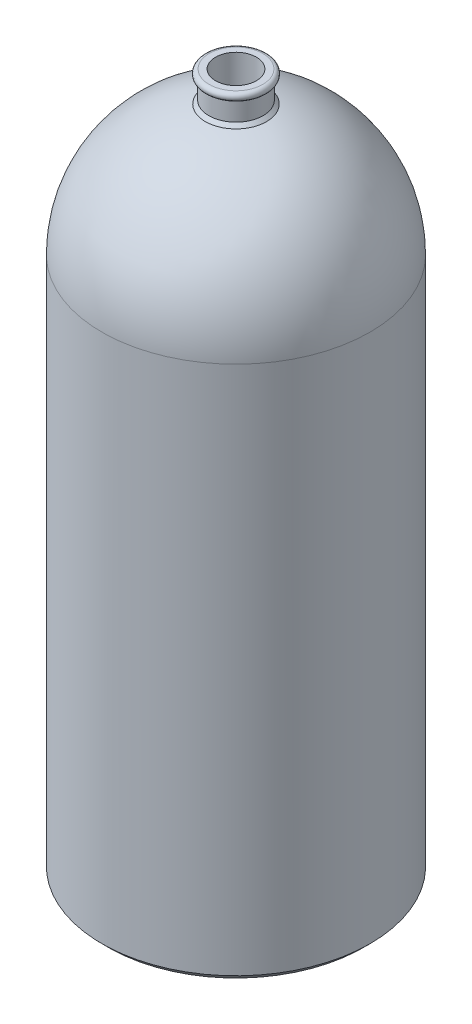
ISO-10303-21;
HEADER;
FILE_DESCRIPTION(('STEP AP214'),'2;1');
FILE_NAME('part.step','',(''),(''),'','','');
FILE_SCHEMA(('AUTOMOTIVE_DESIGN { 1 0 10303 214 1 1 1 1 }'));
ENDSEC;
DATA;
#1=APPLICATION_CONTEXT('core data for automotive mechanical design processes');
#2=APPLICATION_PROTOCOL_DEFINITION('international standard','automotive_design',2000,#1);
#3=PRODUCT_CONTEXT('',#1,'mechanical');
#4=PRODUCT('Part','Part','',(#3));
#5=PRODUCT_RELATED_PRODUCT_CATEGORY('part','',(#4));
#6=PRODUCT_DEFINITION_FORMATION('','',#4);
#7=PRODUCT_DEFINITION_CONTEXT('part definition',#1,'design');
#8=PRODUCT_DEFINITION('design','',#6,#7);
#9=PRODUCT_DEFINITION_SHAPE('','',#8);
#10=(LENGTH_UNIT() NAMED_UNIT(*) SI_UNIT(.MILLI.,.METRE.));
#11=(NAMED_UNIT(*) PLANE_ANGLE_UNIT() SI_UNIT($,.RADIAN.));
#12=(NAMED_UNIT(*) SI_UNIT($,.STERADIAN.) SOLID_ANGLE_UNIT());
#13=UNCERTAINTY_MEASURE_WITH_UNIT(LENGTH_MEASURE(1.E-05),#10,'distance_accuracy_value','');
#14=(GEOMETRIC_REPRESENTATION_CONTEXT(3) GLOBAL_UNCERTAINTY_ASSIGNED_CONTEXT((#13)) GLOBAL_UNIT_ASSIGNED_CONTEXT((#10,
#11,#12)) REPRESENTATION_CONTEXT('',''));
#15=CARTESIAN_POINT('',(0.,0.,0.));
#16=DIRECTION('',(0.,0.,1.));
#17=DIRECTION('',(1.,0.,0.));
#18=AXIS2_PLACEMENT_3D('',#15,#16,#17);
#19=CARTESIAN_POINT('',(-10.253117738076,0.,0.));
#20=DIRECTION('',(0.,1.,0.));
#21=DIRECTION('',(-1.,0.,0.));
#22=AXIS2_PLACEMENT_3D('',#19,#20,#21);
#23=PLANE('',#22);
#24=CARTESIAN_POINT('',(0.,0.,0.));
#25=DIRECTION('',(0.,1.,0.));
#26=DIRECTION('',(-1.,0.,0.));
#27=AXIS2_PLACEMENT_3D('',#24,#25,#26);
#28=CIRCLE('',#27,8.25311773807597);
#29=CARTESIAN_POINT('',(-8.25311773807597,0.,0.));
#30=VERTEX_POINT('',#29);
#31=EDGE_CURVE('E99',#30,#30,#28,.F.);
#32=ORIENTED_EDGE('',*,*,#31,.T.);
#33=EDGE_LOOP('',(#32));
#34=FACE_BOUND('',#33,.T.);
#35=ADVANCED_FACE('F34',(#34),#23,.F.);
#36=CARTESIAN_POINT('',(-20.,520.,0.));
#37=DIRECTION('',(0.,-1.,0.));
#38=DIRECTION('',(1.,0.,0.));
#39=AXIS2_PLACEMENT_3D('',#36,#37,#38);
#40=PLANE('',#39);
#41=CARTESIAN_POINT('',(0.,520.,0.));
#42=DIRECTION('',(0.,-1.,0.));
#43=DIRECTION('',(1.,0.,0.));
#44=AXIS2_PLACEMENT_3D('',#41,#42,#43);
#45=CIRCLE('',#44,15.253117738076);
#46=CARTESIAN_POINT('',(15.253117738076,520.,0.));
#47=VERTEX_POINT('',#46);
#48=EDGE_CURVE('E129',#47,#47,#45,.T.);
#49=ORIENTED_EDGE('',*,*,#48,.T.);
#50=EDGE_LOOP('',(#49));
#51=FACE_BOUND('',#50,.T.);
#52=CARTESIAN_POINT('',(0.,520.,0.));
#53=DIRECTION('',(0.,-1.,0.));
#54=DIRECTION('',(1.,0.,0.));
#55=AXIS2_PLACEMENT_3D('',#52,#53,#54);
#56=CIRCLE('',#55,20.);
#57=CARTESIAN_POINT('',(20.,520.,0.));
#58=VERTEX_POINT('',#57);
#59=EDGE_CURVE('E102',#58,#58,#56,.T.);
#60=ORIENTED_EDGE('',*,*,#59,.F.);
#61=EDGE_LOOP('',(#60));
#62=FACE_BOUND('',#61,.T.);
#63=ADVANCED_FACE('F154',(#51,#62),#40,.F.);
#64=CARTESIAN_POINT('',(0.,517.,0.));
#65=DIRECTION('',(0.,-1.,0.));
#66=DIRECTION('',(1.,0.,0.));
#67=AXIS2_PLACEMENT_3D('',#64,#65,#66);
#68=TOROIDAL_SURFACE('',#67,20.,3.);
#69=CARTESIAN_POINT('',(0.,514.010697169795,0.));
#70=DIRECTION('',(0.,-1.,0.));
#71=DIRECTION('',(1.,0.,0.));
#72=AXIS2_PLACEMENT_3D('',#69,#70,#71);
#73=CIRCLE('',#72,20.253117738076);
#74=CARTESIAN_POINT('',(20.253117738076,514.010697169795,0.));
#75=VERTEX_POINT('',#74);
#76=EDGE_CURVE('E105',#75,#75,#73,.T.);
#77=ORIENTED_EDGE('',*,*,#76,.F.);
#78=EDGE_LOOP('',(#77));
#79=FACE_BOUND('',#78,.T.);
#80=ORIENTED_EDGE('',*,*,#59,.T.);
#81=EDGE_LOOP('',(#80));
#82=FACE_BOUND('',#81,.T.);
#83=ADVANCED_FACE('F160',(#79,#82),#68,.T.);
#84=CARTESIAN_POINT('',(0.,0.,0.));
#85=DIRECTION('',(0.,-1.,0.));
#86=DIRECTION('',(1.,0.,0.));
#87=AXIS2_PLACEMENT_3D('',#84,#85,#86);
#88=CYLINDRICAL_SURFACE('',#87,20.253117738076);
#89=CARTESIAN_POINT('',(0.,499.927581517607,0.));
#90=DIRECTION('',(0.,-1.,0.));
#91=DIRECTION('',(1.,0.,0.));
#92=AXIS2_PLACEMENT_3D('',#89,#90,#91);
#93=CIRCLE('',#92,20.253117738076);
#94=CARTESIAN_POINT('',(20.253117738076,499.927581517607,0.));
#95=VERTEX_POINT('',#94);
#96=EDGE_CURVE('E54',#95,#95,#93,.F.);
#97=ORIENTED_EDGE('',*,*,#96,.T.);
#98=EDGE_LOOP('',(#97));
#99=FACE_BOUND('',#98,.T.);
#100=ORIENTED_EDGE('',*,*,#76,.T.);
#101=EDGE_LOOP('',(#100));
#102=FACE_BOUND('',#101,.T.);
#103=ADVANCED_FACE('F218',(#99,#102),#88,.T.);
#104=CARTESIAN_POINT('',(-1.21430643318376E-13,400.,0.));
#105=DIRECTION('',(0.,-1.,0.));
#106=DIRECTION('',(-1.,0.,0.));
#107=AXIS2_PLACEMENT_3D('',#104,#105,#106);
#108=SPHERICAL_SURFACE('',#107,99.9999999999999);
#109=CARTESIAN_POINT('',(-1.21616808557346E-13,497.361650673066,0.));
#110=DIRECTION('',(0.,-1.,0.));
#111=DIRECTION('',(1.,0.,0.));
#112=AXIS2_PLACEMENT_3D('',#109,#110,#111);
#113=CIRCLE('',#112,22.8190485826174);
#114=CARTESIAN_POINT('',(22.8190485826173,497.361650673066,0.));
#115=VERTEX_POINT('',#114);
#116=EDGE_CURVE('E57',#115,#115,#113,.T.);
#117=ORIENTED_EDGE('',*,*,#116,.T.);
#118=EDGE_LOOP('',(#117));
#119=FACE_BOUND('',#118,.T.);
#120=CARTESIAN_POINT('',(0.,400.,0.));
#121=DIRECTION('',(0.,-1.,0.));
#122=DIRECTION('',(1.,0.,0.));
#123=AXIS2_PLACEMENT_3D('',#120,#121,#122);
#124=CIRCLE('',#123,100.);
#125=CARTESIAN_POINT('',(100.,400.,0.));
#126=VERTEX_POINT('',#125);
#127=EDGE_CURVE('E108',#126,#126,#124,.T.);
#128=ORIENTED_EDGE('',*,*,#127,.F.);
#129=EDGE_LOOP('',(#128));
#130=FACE_BOUND('',#129,.T.);
#131=ADVANCED_FACE('F223',(#119,#130),#108,.T.);
#132=CARTESIAN_POINT('',(0.,0.,0.));
#133=DIRECTION('',(0.,-1.,0.));
#134=DIRECTION('',(1.,0.,0.));
#135=AXIS2_PLACEMENT_3D('',#132,#133,#134);
#136=CYLINDRICAL_SURFACE('',#135,100.);
#137=ORIENTED_EDGE('',*,*,#127,.T.);
#138=EDGE_LOOP('',(#137));
#139=FACE_BOUND('',#138,.T.);
#140=CARTESIAN_POINT('',(0.,5.00000000000014,0.));
#141=DIRECTION('',(0.,1.,0.));
#142=DIRECTION('',(-1.,0.,0.));
#143=AXIS2_PLACEMENT_3D('',#140,#141,#142);
#144=CIRCLE('',#143,100.);
#145=CARTESIAN_POINT('',(-100.,5.00000000000014,0.));
#146=VERTEX_POINT('',#145);
#147=EDGE_CURVE('E60',#146,#146,#144,.T.);
#148=ORIENTED_EDGE('',*,*,#147,.T.);
#149=EDGE_LOOP('',(#148));
#150=FACE_BOUND('',#149,.T.);
#151=ADVANCED_FACE('F230',(#139,#150),#136,.T.);
#152=CARTESIAN_POINT('',(-100.,0.,0.));
#153=DIRECTION('',(0.,1.,0.));
#154=DIRECTION('',(-1.,0.,0.));
#155=AXIS2_PLACEMENT_3D('',#152,#153,#154);
#156=PLANE('',#155);
#157=CARTESIAN_POINT('',(0.,0.,0.));
#158=DIRECTION('',(0.,1.,0.));
#159=DIRECTION('',(-1.,0.,0.));
#160=AXIS2_PLACEMENT_3D('',#157,#158,#159);
#161=CIRCLE('',#160,94.9999999999999);
#162=CARTESIAN_POINT('',(-94.9999999999999,0.,0.));
#163=VERTEX_POINT('',#162);
#164=EDGE_CURVE('E63',#163,#163,#161,.F.);
#165=ORIENTED_EDGE('',*,*,#164,.T.);
#166=EDGE_LOOP('',(#165));
#167=FACE_BOUND('',#166,.T.);
#168=CARTESIAN_POINT('',(0.,0.,0.));
#169=DIRECTION('',(0.,1.,0.));
#170=DIRECTION('',(-1.,0.,0.));
#171=AXIS2_PLACEMENT_3D('',#168,#169,#170);
#172=CIRCLE('',#171,85.5485275751154);
#173=CARTESIAN_POINT('',(-85.5485275751154,0.,0.));
#174=VERTEX_POINT('',#173);
#175=EDGE_CURVE('E66',#174,#174,#172,.T.);
#176=ORIENTED_EDGE('',*,*,#175,.T.);
#177=EDGE_LOOP('',(#176));
#178=FACE_BOUND('',#177,.T.);
#179=ADVANCED_FACE('F234',(#167,#178),#156,.F.);
#180=CARTESIAN_POINT('',(0.,0.,0.));
#181=DIRECTION('',(0.,-1.,0.));
#182=DIRECTION('',(1.,0.,0.));
#183=AXIS2_PLACEMENT_3D('',#180,#181,#182);
#184=CYLINDRICAL_SURFACE('',#183,83.5485275751153);
#185=CARTESIAN_POINT('',(0.,2.00000000000014,0.));
#186=DIRECTION('',(0.,1.,0.));
#187=DIRECTION('',(-1.,0.,0.));
#188=AXIS2_PLACEMENT_3D('',#185,#186,#187);
#189=CIRCLE('',#188,83.5485275751153);
#190=CARTESIAN_POINT('',(-83.5485275751153,2.00000000000014,0.));
#191=VERTEX_POINT('',#190);
#192=EDGE_CURVE('E69',#191,#191,#189,.F.);
#193=ORIENTED_EDGE('',*,*,#192,.T.);
#194=EDGE_LOOP('',(#193));
#195=FACE_BOUND('',#194,.T.);
#196=CARTESIAN_POINT('',(0.,3.,0.));
#197=DIRECTION('',(0.,-1.,0.));
#198=DIRECTION('',(1.,0.,0.));
#199=AXIS2_PLACEMENT_3D('',#196,#197,#198);
#200=CIRCLE('',#199,83.5485275751153);
#201=CARTESIAN_POINT('',(83.5485275751153,3.,0.));
#202=VERTEX_POINT('',#201);
#203=EDGE_CURVE('E111',#202,#202,#200,.T.);
#204=ORIENTED_EDGE('',*,*,#203,.F.);
#205=EDGE_LOOP('',(#204));
#206=FACE_BOUND('',#205,.T.);
#207=ADVANCED_FACE('F238',(#195,#206),#184,.F.);
#208=CARTESIAN_POINT('',(-83.5485275751153,3.,0.));
#209=DIRECTION('',(0.,1.,0.));
#210=DIRECTION('',(-1.,0.,0.));
#211=AXIS2_PLACEMENT_3D('',#208,#209,#210);
#212=PLANE('',#211);
#213=CARTESIAN_POINT('',(0.,3.,0.));
#214=DIRECTION('',(0.,-1.,0.));
#215=DIRECTION('',(1.,0.,0.));
#216=AXIS2_PLACEMENT_3D('',#213,#214,#215);
#217=CIRCLE('',#216,73.5485275751153);
#218=CARTESIAN_POINT('',(73.5485275751153,3.,0.));
#219=VERTEX_POINT('',#218);
#220=EDGE_CURVE('E114',#219,#219,#217,.T.);
#221=ORIENTED_EDGE('',*,*,#220,.F.);
#222=EDGE_LOOP('',(#221));
#223=FACE_BOUND('',#222,.T.);
#224=ORIENTED_EDGE('',*,*,#203,.T.);
#225=EDGE_LOOP('',(#224));
#226=FACE_BOUND('',#225,.T.);
#227=ADVANCED_FACE('F242',(#223,#226),#212,.F.);
#228=CARTESIAN_POINT('',(0.,0.,0.));
#229=DIRECTION('',(0.,-1.,0.));
#230=DIRECTION('',(1.,0.,0.));
#231=AXIS2_PLACEMENT_3D('',#228,#229,#230);
#232=CYLINDRICAL_SURFACE('',#231,73.5485275751153);
#233=CARTESIAN_POINT('',(0.,2.00000000000011,0.));
#234=DIRECTION('',(0.,1.,0.));
#235=DIRECTION('',(-1.,0.,0.));
#236=AXIS2_PLACEMENT_3D('',#233,#234,#235);
#237=CIRCLE('',#236,73.5485275751153);
#238=CARTESIAN_POINT('',(-73.5485275751153,2.00000000000011,0.));
#239=VERTEX_POINT('',#238);
#240=EDGE_CURVE('E72',#239,#239,#237,.T.);
#241=ORIENTED_EDGE('',*,*,#240,.T.);
#242=EDGE_LOOP('',(#241));
#243=FACE_BOUND('',#242,.T.);
#244=ORIENTED_EDGE('',*,*,#220,.T.);
#245=EDGE_LOOP('',(#244));
#246=FACE_BOUND('',#245,.T.);
#247=ADVANCED_FACE('F246',(#243,#246),#232,.T.);
#248=CARTESIAN_POINT('',(-73.5485275751153,0.,0.));
#249=DIRECTION('',(0.,1.,0.));
#250=DIRECTION('',(-1.,0.,0.));
#251=AXIS2_PLACEMENT_3D('',#248,#249,#250);
#252=PLANE('',#251);
#253=CARTESIAN_POINT('',(0.,0.,0.));
#254=DIRECTION('',(0.,1.,0.));
#255=DIRECTION('',(-1.,0.,0.));
#256=AXIS2_PLACEMENT_3D('',#253,#254,#255);
#257=CIRCLE('',#256,65.5485275751153);
#258=CARTESIAN_POINT('',(-65.5485275751153,0.,0.));
#259=VERTEX_POINT('',#258);
#260=EDGE_CURVE('E75',#259,#259,#257,.T.);
#261=ORIENTED_EDGE('',*,*,#260,.T.);
#262=EDGE_LOOP('',(#261));
#263=FACE_BOUND('',#262,.T.);
#264=CARTESIAN_POINT('',(0.,0.,0.));
#265=DIRECTION('',(0.,1.,0.));
#266=DIRECTION('',(-1.,0.,0.));
#267=AXIS2_PLACEMENT_3D('',#264,#265,#266);
#268=CIRCLE('',#267,71.5485275751151);
#269=CARTESIAN_POINT('',(-71.5485275751151,0.,0.));
#270=VERTEX_POINT('',#269);
#271=EDGE_CURVE('E78',#270,#270,#268,.F.);
#272=ORIENTED_EDGE('',*,*,#271,.T.);
#273=EDGE_LOOP('',(#272));
#274=FACE_BOUND('',#273,.T.);
#275=ADVANCED_FACE('F250',(#263,#274),#252,.F.);
#276=CARTESIAN_POINT('',(0.,0.,0.));
#277=DIRECTION('',(0.,-1.,0.));
#278=DIRECTION('',(1.,0.,0.));
#279=AXIS2_PLACEMENT_3D('',#276,#277,#278);
#280=CYLINDRICAL_SURFACE('',#279,63.5485275751153);
#281=CARTESIAN_POINT('',(0.,1.99999999999992,0.));
#282=DIRECTION('',(0.,1.,0.));
#283=DIRECTION('',(-1.,0.,0.));
#284=AXIS2_PLACEMENT_3D('',#281,#282,#283);
#285=CIRCLE('',#284,63.5485275751153);
#286=CARTESIAN_POINT('',(-63.5485275751153,1.99999999999992,0.));
#287=VERTEX_POINT('',#286);
#288=EDGE_CURVE('E81',#287,#287,#285,.F.);
#289=ORIENTED_EDGE('',*,*,#288,.T.);
#290=EDGE_LOOP('',(#289));
#291=FACE_BOUND('',#290,.T.);
#292=CARTESIAN_POINT('',(0.,3.,0.));
#293=DIRECTION('',(0.,-1.,0.));
#294=DIRECTION('',(1.,0.,0.));
#295=AXIS2_PLACEMENT_3D('',#292,#293,#294);
#296=CIRCLE('',#295,63.5485275751153);
#297=CARTESIAN_POINT('',(63.5485275751153,3.,0.));
#298=VERTEX_POINT('',#297);
#299=EDGE_CURVE('E117',#298,#298,#296,.T.);
#300=ORIENTED_EDGE('',*,*,#299,.F.);
#301=EDGE_LOOP('',(#300));
#302=FACE_BOUND('',#301,.T.);
#303=ADVANCED_FACE('F254',(#291,#302),#280,.F.);
#304=CARTESIAN_POINT('',(-63.5485275751153,3.,0.));
#305=DIRECTION('',(0.,1.,0.));
#306=DIRECTION('',(-1.,0.,0.));
#307=AXIS2_PLACEMENT_3D('',#304,#305,#306);
#308=PLANE('',#307);
#309=CARTESIAN_POINT('',(0.,3.,0.));
#310=DIRECTION('',(0.,-1.,0.));
#311=DIRECTION('',(1.,0.,0.));
#312=AXIS2_PLACEMENT_3D('',#309,#310,#311);
#313=CIRCLE('',#312,53.5485275751153);
#314=CARTESIAN_POINT('',(53.5485275751153,3.,0.));
#315=VERTEX_POINT('',#314);
#316=EDGE_CURVE('E120',#315,#315,#313,.T.);
#317=ORIENTED_EDGE('',*,*,#316,.F.);
#318=EDGE_LOOP('',(#317));
#319=FACE_BOUND('',#318,.T.);
#320=ORIENTED_EDGE('',*,*,#299,.T.);
#321=EDGE_LOOP('',(#320));
#322=FACE_BOUND('',#321,.T.);
#323=ADVANCED_FACE('F258',(#319,#322),#308,.F.);
#324=CARTESIAN_POINT('',(0.,0.,0.));
#325=DIRECTION('',(0.,-1.,0.));
#326=DIRECTION('',(1.,0.,0.));
#327=AXIS2_PLACEMENT_3D('',#324,#325,#326);
#328=CYLINDRICAL_SURFACE('',#327,53.5485275751153);
#329=CARTESIAN_POINT('',(0.,2.00000000000008,0.));
#330=DIRECTION('',(0.,1.,0.));
#331=DIRECTION('',(-1.,0.,0.));
#332=AXIS2_PLACEMENT_3D('',#329,#330,#331);
#333=CIRCLE('',#332,53.5485275751153);
#334=CARTESIAN_POINT('',(-53.5485275751153,2.00000000000008,0.));
#335=VERTEX_POINT('',#334);
#336=EDGE_CURVE('E84',#335,#335,#333,.T.);
#337=ORIENTED_EDGE('',*,*,#336,.T.);
#338=EDGE_LOOP('',(#337));
#339=FACE_BOUND('',#338,.T.);
#340=ORIENTED_EDGE('',*,*,#316,.T.);
#341=EDGE_LOOP('',(#340));
#342=FACE_BOUND('',#341,.T.);
#343=ADVANCED_FACE('F262',(#339,#342),#328,.T.);
#344=CARTESIAN_POINT('',(-53.5485275751153,0.,0.));
#345=DIRECTION('',(0.,1.,0.));
#346=DIRECTION('',(-1.,0.,0.));
#347=AXIS2_PLACEMENT_3D('',#344,#345,#346);
#348=PLANE('',#347);
#349=CARTESIAN_POINT('',(0.,0.,0.));
#350=DIRECTION('',(0.,1.,0.));
#351=DIRECTION('',(-1.,0.,0.));
#352=AXIS2_PLACEMENT_3D('',#349,#350,#351);
#353=CIRCLE('',#352,22.2531177380761);
#354=CARTESIAN_POINT('',(-22.2531177380761,0.,0.));
#355=VERTEX_POINT('',#354);
#356=EDGE_CURVE('E87',#355,#355,#353,.T.);
#357=ORIENTED_EDGE('',*,*,#356,.T.);
#358=EDGE_LOOP('',(#357));
#359=FACE_BOUND('',#358,.T.);
#360=CARTESIAN_POINT('',(0.,0.,0.));
#361=DIRECTION('',(0.,1.,0.));
#362=DIRECTION('',(-1.,0.,0.));
#363=AXIS2_PLACEMENT_3D('',#360,#361,#362);
#364=CIRCLE('',#363,51.5485275751152);
#365=CARTESIAN_POINT('',(-51.5485275751152,0.,0.));
#366=VERTEX_POINT('',#365);
#367=EDGE_CURVE('E90',#366,#366,#364,.F.);
#368=ORIENTED_EDGE('',*,*,#367,.T.);
#369=EDGE_LOOP('',(#368));
#370=FACE_BOUND('',#369,.T.);
#371=ADVANCED_FACE('F266',(#359,#370),#348,.F.);
#372=CARTESIAN_POINT('',(0.,0.,0.));
#373=DIRECTION('',(0.,-1.,0.));
#374=DIRECTION('',(1.,0.,0.));
#375=AXIS2_PLACEMENT_3D('',#372,#373,#374);
#376=CYLINDRICAL_SURFACE('',#375,20.253117738076);
#377=CARTESIAN_POINT('',(0.,2.00000000000007,0.));
#378=DIRECTION('',(0.,1.,0.));
#379=DIRECTION('',(-1.,0.,0.));
#380=AXIS2_PLACEMENT_3D('',#377,#378,#379);
#381=CIRCLE('',#380,20.253117738076);
#382=CARTESIAN_POINT('',(-20.253117738076,2.00000000000007,0.));
#383=VERTEX_POINT('',#382);
#384=EDGE_CURVE('E93',#383,#383,#381,.F.);
#385=ORIENTED_EDGE('',*,*,#384,.T.);
#386=EDGE_LOOP('',(#385));
#387=FACE_BOUND('',#386,.T.);
#388=CARTESIAN_POINT('',(0.,3.,0.));
#389=DIRECTION('',(0.,-1.,0.));
#390=DIRECTION('',(1.,0.,0.));
#391=AXIS2_PLACEMENT_3D('',#388,#389,#390);
#392=CIRCLE('',#391,20.253117738076);
#393=CARTESIAN_POINT('',(20.253117738076,3.,0.));
#394=VERTEX_POINT('',#393);
#395=EDGE_CURVE('E123',#394,#394,#392,.T.);
#396=ORIENTED_EDGE('',*,*,#395,.F.);
#397=EDGE_LOOP('',(#396));
#398=FACE_BOUND('',#397,.T.);
#399=ADVANCED_FACE('F270',(#387,#398),#376,.F.);
#400=CARTESIAN_POINT('',(-20.253117738076,3.,0.));
#401=DIRECTION('',(0.,1.,0.));
#402=DIRECTION('',(-1.,0.,0.));
#403=AXIS2_PLACEMENT_3D('',#400,#401,#402);
#404=PLANE('',#403);
#405=CARTESIAN_POINT('',(0.,3.,0.));
#406=DIRECTION('',(0.,-1.,0.));
#407=DIRECTION('',(1.,0.,0.));
#408=AXIS2_PLACEMENT_3D('',#405,#406,#407);
#409=CIRCLE('',#408,10.253117738076);
#410=CARTESIAN_POINT('',(10.253117738076,3.,0.));
#411=VERTEX_POINT('',#410);
#412=EDGE_CURVE('E126',#411,#411,#409,.T.);
#413=ORIENTED_EDGE('',*,*,#412,.F.);
#414=EDGE_LOOP('',(#413));
#415=FACE_BOUND('',#414,.T.);
#416=ORIENTED_EDGE('',*,*,#395,.T.);
#417=EDGE_LOOP('',(#416));
#418=FACE_BOUND('',#417,.T.);
#419=ADVANCED_FACE('F274',(#415,#418),#404,.F.);
#420=CARTESIAN_POINT('',(0.,0.,0.));
#421=DIRECTION('',(0.,-1.,0.));
#422=DIRECTION('',(1.,0.,0.));
#423=AXIS2_PLACEMENT_3D('',#420,#421,#422);
#424=CYLINDRICAL_SURFACE('',#423,10.253117738076);
#425=CARTESIAN_POINT('',(0.,2.00000000000008,0.));
#426=DIRECTION('',(0.,1.,0.));
#427=DIRECTION('',(-1.,0.,0.));
#428=AXIS2_PLACEMENT_3D('',#425,#426,#427);
#429=CIRCLE('',#428,10.253117738076);
#430=CARTESIAN_POINT('',(-10.253117738076,2.00000000000008,0.));
#431=VERTEX_POINT('',#430);
#432=EDGE_CURVE('E96',#431,#431,#429,.T.);
#433=ORIENTED_EDGE('',*,*,#432,.T.);
#434=EDGE_LOOP('',(#433));
#435=FACE_BOUND('',#434,.T.);
#436=ORIENTED_EDGE('',*,*,#412,.T.);
#437=EDGE_LOOP('',(#436));
#438=FACE_BOUND('',#437,.T.);
#439=ADVANCED_FACE('F169',(#435,#438),#424,.T.);
#440=CARTESIAN_POINT('',(0.,0.,0.));
#441=DIRECTION('',(0.,1.,0.));
#442=DIRECTION('',(-1.,0.,0.));
#443=AXIS2_PLACEMENT_3D('',#440,#441,#442);
#444=CONICAL_SURFACE('',#443,8.25311773807597,0.78539816339744);
#445=ORIENTED_EDGE('',*,*,#432,.F.);
#446=EDGE_LOOP('',(#445));
#447=FACE_BOUND('',#446,.T.);
#448=ORIENTED_EDGE('',*,*,#31,.F.);
#449=EDGE_LOOP('',(#448));
#450=FACE_BOUND('',#449,.T.);
#451=ADVANCED_FACE('F165',(#447,#450),#444,.T.);
#452=CARTESIAN_POINT('',(0.,2.00000000000007,0.));
#453=DIRECTION('',(0.,-1.,0.));
#454=DIRECTION('',(1.,0.,0.));
#455=AXIS2_PLACEMENT_3D('',#452,#453,#454);
#456=CONICAL_SURFACE('',#455,20.253117738076,0.785398163397448);
#457=ORIENTED_EDGE('',*,*,#356,.F.);
#458=EDGE_LOOP('',(#457));
#459=FACE_BOUND('',#458,.T.);
#460=ORIENTED_EDGE('',*,*,#384,.F.);
#461=EDGE_LOOP('',(#460));
#462=FACE_BOUND('',#461,.T.);
#463=ADVANCED_FACE('F168',(#459,#462),#456,.F.);
#464=CARTESIAN_POINT('',(0.,0.,0.));
#465=DIRECTION('',(0.,1.,0.));
#466=DIRECTION('',(-1.,0.,0.));
#467=AXIS2_PLACEMENT_3D('',#464,#465,#466);
#468=CONICAL_SURFACE('',#467,51.5485275751152,0.785398163397446);
#469=ORIENTED_EDGE('',*,*,#336,.F.);
#470=EDGE_LOOP('',(#469));
#471=FACE_BOUND('',#470,.T.);
#472=ORIENTED_EDGE('',*,*,#367,.F.);
#473=EDGE_LOOP('',(#472));
#474=FACE_BOUND('',#473,.T.);
#475=ADVANCED_FACE('F173',(#471,#474),#468,.T.);
#476=CARTESIAN_POINT('',(0.,1.99999999999992,0.));
#477=DIRECTION('',(0.,-1.,0.));
#478=DIRECTION('',(1.,0.,0.));
#479=AXIS2_PLACEMENT_3D('',#476,#477,#478);
#480=CONICAL_SURFACE('',#479,63.5485275751153,0.785398163397463);
#481=ORIENTED_EDGE('',*,*,#260,.F.);
#482=EDGE_LOOP('',(#481));
#483=FACE_BOUND('',#482,.T.);
#484=ORIENTED_EDGE('',*,*,#288,.F.);
#485=EDGE_LOOP('',(#484));
#486=FACE_BOUND('',#485,.T.);
#487=ADVANCED_FACE('F177',(#483,#486),#480,.F.);
#488=CARTESIAN_POINT('',(0.,0.,0.));
#489=DIRECTION('',(0.,1.,0.));
#490=DIRECTION('',(-1.,0.,0.));
#491=AXIS2_PLACEMENT_3D('',#488,#489,#490);
#492=CONICAL_SURFACE('',#491,71.5485275751151,0.785398163397455);
#493=ORIENTED_EDGE('',*,*,#240,.F.);
#494=EDGE_LOOP('',(#493));
#495=FACE_BOUND('',#494,.T.);
#496=ORIENTED_EDGE('',*,*,#271,.F.);
#497=EDGE_LOOP('',(#496));
#498=FACE_BOUND('',#497,.T.);
#499=ADVANCED_FACE('F181',(#495,#498),#492,.T.);
#500=CARTESIAN_POINT('',(0.,2.00000000000014,0.));
#501=DIRECTION('',(0.,-1.,0.));
#502=DIRECTION('',(1.,0.,0.));
#503=AXIS2_PLACEMENT_3D('',#500,#501,#502);
#504=CONICAL_SURFACE('',#503,83.5485275751153,0.785398163397444);
#505=ORIENTED_EDGE('',*,*,#175,.F.);
#506=EDGE_LOOP('',(#505));
#507=FACE_BOUND('',#506,.T.);
#508=ORIENTED_EDGE('',*,*,#192,.F.);
#509=EDGE_LOOP('',(#508));
#510=FACE_BOUND('',#509,.T.);
#511=ADVANCED_FACE('F185',(#507,#510),#504,.F.);
#512=CARTESIAN_POINT('',(0.,0.,0.));
#513=DIRECTION('',(0.,1.,0.));
#514=DIRECTION('',(-1.,0.,0.));
#515=AXIS2_PLACEMENT_3D('',#512,#513,#514);
#516=CONICAL_SURFACE('',#515,94.9999999999999,0.785398163397448);
#517=ORIENTED_EDGE('',*,*,#147,.F.);
#518=EDGE_LOOP('',(#517));
#519=FACE_BOUND('',#518,.T.);
#520=ORIENTED_EDGE('',*,*,#164,.F.);
#521=EDGE_LOOP('',(#520));
#522=FACE_BOUND('',#521,.T.);
#523=ADVANCED_FACE('F189',(#519,#522),#516,.T.);
#524=CARTESIAN_POINT('',(0.,0.,0.));
#525=DIRECTION('',(0.,-1.,0.));
#526=DIRECTION('',(1.,0.,0.));
#527=AXIS2_PLACEMENT_3D('',#524,#525,#526);
#528=CYLINDRICAL_SURFACE('',#527,15.253117738076);
#529=CARTESIAN_POINT('',(0.,495.453286629199,0.));
#530=DIRECTION('',(0.,-1.,0.));
#531=DIRECTION('',(1.,0.,0.));
#532=AXIS2_PLACEMENT_3D('',#529,#530,#531);
#533=CIRCLE('',#532,15.253117738076);
#534=CARTESIAN_POINT('',(15.253117738076,495.453286629199,0.));
#535=VERTEX_POINT('',#534);
#536=EDGE_CURVE('E41',#535,#535,#533,.T.);
#537=ORIENTED_EDGE('',*,*,#536,.T.);
#538=EDGE_LOOP('',(#537));
#539=FACE_BOUND('',#538,.T.);
#540=ORIENTED_EDGE('',*,*,#48,.F.);
#541=EDGE_LOOP('',(#540));
#542=FACE_BOUND('',#541,.T.);
#543=ADVANCED_FACE('F150',(#539,#542),#528,.F.);
#544=CARTESIAN_POINT('',(-1.21430643318376E-13,400.,0.));
#545=DIRECTION('',(0.,-1.,0.));
#546=DIRECTION('',(-1.,0.,0.));
#547=AXIS2_PLACEMENT_3D('',#544,#545,#546);
#548=SPHERICAL_SURFACE('',#547,94.9999999999999);
#549=CARTESIAN_POINT('',(-1.2160939635217E-13,493.485177626535,0.));
#550=DIRECTION('',(0.,-1.,0.));
#551=DIRECTION('',(1.,0.,0.));
#552=AXIS2_PLACEMENT_3D('',#549,#550,#551);
#553=CIRCLE('',#552,16.8973833517239);
#554=CARTESIAN_POINT('',(16.8973833517238,493.485177626535,0.));
#555=VERTEX_POINT('',#554);
#556=EDGE_CURVE('E10',#555,#555,#553,.F.);
#557=ORIENTED_EDGE('',*,*,#556,.T.);
#558=EDGE_LOOP('',(#557));
#559=FACE_BOUND('',#558,.T.);
#560=CARTESIAN_POINT('',(0.,400.,0.));
#561=DIRECTION('',(0.,-1.,0.));
#562=DIRECTION('',(1.,0.,0.));
#563=AXIS2_PLACEMENT_3D('',#560,#561,#562);
#564=CIRCLE('',#563,95.);
#565=CARTESIAN_POINT('',(95.,400.,0.));
#566=VERTEX_POINT('',#565);
#567=EDGE_CURVE('E132',#566,#566,#564,.T.);
#568=ORIENTED_EDGE('',*,*,#567,.T.);
#569=EDGE_LOOP('',(#568));
#570=FACE_BOUND('',#569,.T.);
#571=ADVANCED_FACE('F136',(#559,#570),#548,.F.);
#572=CARTESIAN_POINT('',(0.,0.,0.));
#573=DIRECTION('',(0.,-1.,0.));
#574=DIRECTION('',(1.,0.,0.));
#575=AXIS2_PLACEMENT_3D('',#572,#573,#574);
#576=CYLINDRICAL_SURFACE('',#575,95.);
#577=CARTESIAN_POINT('',(0.,20.,0.));
#578=DIRECTION('',(0.,1.,0.));
#579=DIRECTION('',(-1.,0.,0.));
#580=AXIS2_PLACEMENT_3D('',#577,#578,#579);
#581=CIRCLE('',#580,95.);
#582=CARTESIAN_POINT('',(-95.,20.,0.));
#583=VERTEX_POINT('',#582);
#584=EDGE_CURVE('E45',#583,#583,#581,.F.);
#585=ORIENTED_EDGE('',*,*,#584,.T.);
#586=EDGE_LOOP('',(#585));
#587=FACE_BOUND('',#586,.T.);
#588=ORIENTED_EDGE('',*,*,#567,.F.);
#589=EDGE_LOOP('',(#588));
#590=FACE_BOUND('',#589,.T.);
#591=ADVANCED_FACE('F138',(#587,#590),#576,.F.);
#592=CARTESIAN_POINT('',(0.,497.361650673066,0.));
#593=DIRECTION('',(0.,-1.,0.));
#594=DIRECTION('',(1.,0.,0.));
#595=AXIS2_PLACEMENT_3D('',#592,#593,#594);
#596=CONICAL_SURFACE('',#595,22.8190485826174,0.78539816339745);
#597=ORIENTED_EDGE('',*,*,#96,.F.);
#598=EDGE_LOOP('',(#597));
#599=FACE_BOUND('',#598,.T.);
#600=ORIENTED_EDGE('',*,*,#116,.F.);
#601=EDGE_LOOP('',(#600));
#602=FACE_BOUND('',#601,.T.);
#603=ADVANCED_FACE('F140',(#599,#602),#596,.T.);
#604=CARTESIAN_POINT('',(0.,10.,0.));
#605=DIRECTION('',(0.,1.,0.));
#606=DIRECTION('',(-1.,0.,0.));
#607=AXIS2_PLACEMENT_3D('',#604,#605,#606);
#608=PLANE('',#607);
#609=CARTESIAN_POINT('',(0.,10.,0.));
#610=DIRECTION('',(0.,1.,0.));
#611=DIRECTION('',(-1.,0.,0.));
#612=AXIS2_PLACEMENT_3D('',#609,#610,#611);
#613=CIRCLE('',#612,85.);
#614=CARTESIAN_POINT('',(-85.,10.,0.));
#615=VERTEX_POINT('',#614);
#616=EDGE_CURVE('E49',#615,#615,#613,.T.);
#617=ORIENTED_EDGE('',*,*,#616,.T.);
#618=EDGE_LOOP('',(#617));
#619=FACE_BOUND('',#618,.T.);
#620=ADVANCED_FACE('F147',(#619),#608,.T.);
#621=CARTESIAN_POINT('',(0.,20.,0.));
#622=DIRECTION('',(0.,1.,0.));
#623=DIRECTION('',(-1.,0.,0.));
#624=AXIS2_PLACEMENT_3D('',#621,#622,#623);
#625=TOROIDAL_SURFACE('',#624,85.,10.);
#626=ORIENTED_EDGE('',*,*,#584,.F.);
#627=EDGE_LOOP('',(#626));
#628=FACE_BOUND('',#627,.T.);
#629=ORIENTED_EDGE('',*,*,#616,.F.);
#630=EDGE_LOOP('',(#629));
#631=FACE_BOUND('',#630,.T.);
#632=ADVANCED_FACE('F193',(#628,#631),#625,.F.);
#633=CARTESIAN_POINT('',(0.,495.453286629199,0.));
#634=DIRECTION('',(0.,-1.,0.));
#635=DIRECTION('',(1.,0.,0.));
#636=AXIS2_PLACEMENT_3D('',#633,#634,#635);
#637=TOROIDAL_SURFACE('',#636,17.253117738076,2.);
#638=ORIENTED_EDGE('',*,*,#556,.F.);
#639=EDGE_LOOP('',(#638));
#640=FACE_BOUND('',#639,.T.);
#641=ORIENTED_EDGE('',*,*,#536,.F.);
#642=EDGE_LOOP('',(#641));
#643=FACE_BOUND('',#642,.T.);
#644=ADVANCED_FACE('F36',(#640,#643),#637,.T.);
#645=CLOSED_SHELL('',(#35,#63,#83,#103,#131,#151,#179,#207,#227,#247,#275,#303,#323,#343,#371,
#399,#419,#439,#451,#463,#475,#487,#499,#511,#523,#543,#571,#591,#603,#620,#632,#644));
#646=MANIFOLD_SOLID_BREP('B2',#645);
#647=ADVANCED_BREP_SHAPE_REPRESENTATION('',(#18,#646),#14);
#648=SHAPE_DEFINITION_REPRESENTATION(#9,#647);
ENDSEC;
END-ISO-10303-21;
